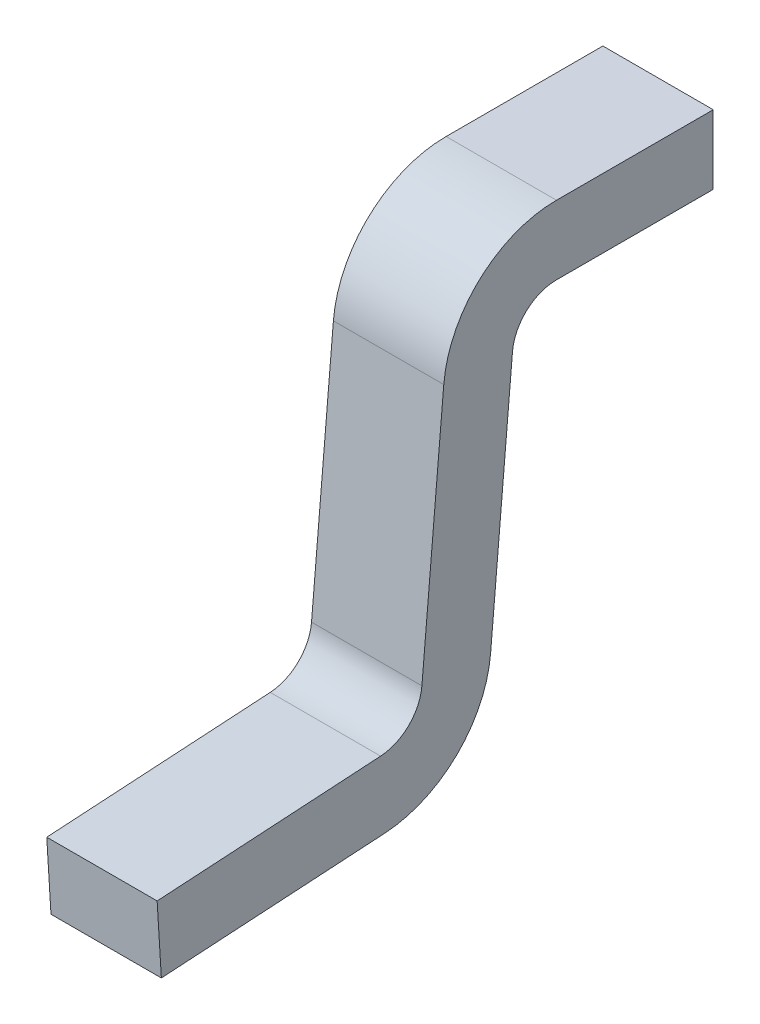
ISO-10303-21;
HEADER;
FILE_DESCRIPTION(('STEP AP214'),'2;1');
FILE_NAME('part.step','',(''),(''),'','','');
FILE_SCHEMA(('AUTOMOTIVE_DESIGN { 1 0 10303 214 1 1 1 1 }'));
ENDSEC;
DATA;
#1=APPLICATION_CONTEXT('core data for automotive mechanical design processes');
#2=APPLICATION_PROTOCOL_DEFINITION('international standard','automotive_design',2000,#1);
#3=PRODUCT_CONTEXT('',#1,'mechanical');
#4=PRODUCT('Part','Part','',(#3));
#5=PRODUCT_RELATED_PRODUCT_CATEGORY('part','',(#4));
#6=PRODUCT_DEFINITION_FORMATION('','',#4);
#7=PRODUCT_DEFINITION_CONTEXT('part definition',#1,'design');
#8=PRODUCT_DEFINITION('design','',#6,#7);
#9=PRODUCT_DEFINITION_SHAPE('','',#8);
#10=(LENGTH_UNIT() NAMED_UNIT(*) SI_UNIT(.MILLI.,.METRE.));
#11=(NAMED_UNIT(*) PLANE_ANGLE_UNIT() SI_UNIT($,.RADIAN.));
#12=(NAMED_UNIT(*) SI_UNIT($,.STERADIAN.) SOLID_ANGLE_UNIT());
#13=UNCERTAINTY_MEASURE_WITH_UNIT(LENGTH_MEASURE(1.E-05),#10,'distance_accuracy_value','');
#14=(GEOMETRIC_REPRESENTATION_CONTEXT(3) GLOBAL_UNCERTAINTY_ASSIGNED_CONTEXT((#13)) GLOBAL_UNIT_ASSIGNED_CONTEXT((#10,
#11,#12)) REPRESENTATION_CONTEXT('',''));
#15=CARTESIAN_POINT('',(0.,0.,0.));
#16=DIRECTION('',(0.,0.,1.));
#17=DIRECTION('',(1.,0.,0.));
#18=AXIS2_PLACEMENT_3D('',#15,#16,#17);
#19=CARTESIAN_POINT('',(0.1,0.,0.));
#20=DIRECTION('',(1.,0.,0.));
#21=DIRECTION('',(0.,0.,-1.));
#22=AXIS2_PLACEMENT_3D('',#19,#20,#21);
#23=PLANE('',#22);
#24=CARTESIAN_POINT('',(0.1,0.4075,-0.11595721739));
#25=DIRECTION('',(-1.,0.,0.));
#26=DIRECTION('',(0.,0.,1.));
#27=AXIS2_PLACEMENT_3D('',#24,#25,#26);
#28=CIRCLE('',#27,0.205);
#29=CARTESIAN_POINT('',(0.1,0.425366927263168,0.0882626957190755));
#30=VERTEX_POINT('',#29);
#31=CARTESIAN_POINT('',(0.1,0.6125,-0.11595721739));
#32=VERTEX_POINT('',#31);
#33=EDGE_CURVE('E196',#30,#32,#28,.T.);
#34=ORIENTED_EDGE('',*,*,#33,.F.);
#35=DIRECTION('',(0.,-0.996194698091747,0.0871557427476379));
#36=VECTOR('',#35,1.);
#37=CARTESIAN_POINT('',(0.1,0.01089446784346,0.124524337262));
#38=LINE('',#37,#36);
#39=CARTESIAN_POINT('',(0.1,-0.0275883544188815,0.127891147950048));
#40=VERTEX_POINT('',#39);
#41=EDGE_CURVE('E193',#40,#30,#38,.F.);
#42=ORIENTED_EDGE('',*,*,#41,.F.);
#43=CARTESIAN_POINT('',(0.1,-0.02061589499909,0.207586723797));
#44=DIRECTION('',(1.,0.,0.));
#45=DIRECTION('',(0.,0.,-1.));
#46=AXIS2_PLACEMENT_3D('',#43,#44,#45);
#47=CIRCLE('',#46,0.08);
#48=CARTESIAN_POINT('',(0.1,-0.10046667887287,0.202702840634609));
#49=VERTEX_POINT('',#48);
#50=EDGE_CURVE('E190',#40,#49,#47,.F.);
#51=ORIENTED_EDGE('',*,*,#50,.T.);
#52=DIRECTION('',(0.,-0.0610485395348519,0.998134798421867));
#53=VECTOR('',#52,1.);
#54=CARTESIAN_POINT('',(0.1,-0.09625845590832,0.133899003353));
#55=LINE('',#54,#53);
#56=CARTESIAN_POINT('',(0.1,-0.125233150197099,0.607631067441994));
#57=VERTEX_POINT('',#56);
#58=EDGE_CURVE('E186',#57,#49,#55,.F.);
#59=ORIENTED_EDGE('',*,*,#58,.F.);
#60=DIRECTION('',(0.,-0.998134798421867,-0.0610485395348519));
#61=VECTOR('',#60,1.);
#62=CARTESIAN_POINT('',(0.1,-0.125233150197,0.607631067442));
#63=LINE('',#62,#61);
#64=CARTESIAN_POINT('',(0.1,-0.250000000000003,0.600000000000042));
#65=VERTEX_POINT('',#64);
#66=EDGE_CURVE('E126',#65,#57,#63,.F.);
#67=ORIENTED_EDGE('',*,*,#66,.F.);
#68=DIRECTION('',(0.,0.0610485395348519,-0.998134798421867));
#69=VECTOR('',#68,1.);
#70=CARTESIAN_POINT('',(0.1,-0.25,0.6));
#71=LINE('',#70,#69);
#72=CARTESIAN_POINT('',(0.1,-0.225233528675585,0.19507177319269));
#73=VERTEX_POINT('',#72);
#74=EDGE_CURVE('E130',#73,#65,#71,.F.);
#75=ORIENTED_EDGE('',*,*,#74,.F.);
#76=CARTESIAN_POINT('',(0.1,-0.02061589499909,0.207586723797));
#77=DIRECTION('',(-1.,0.,0.));
#78=DIRECTION('',(0.,0.,1.));
#79=AXIS2_PLACEMENT_3D('',#76,#77,#78);
#80=CIRCLE('',#79,0.205);
#81=CARTESIAN_POINT('',(0.1,-0.0384828222623575,0.00336681068831962));
#82=VERTEX_POINT('',#81);
#83=EDGE_CURVE('E174',#82,#73,#80,.T.);
#84=ORIENTED_EDGE('',*,*,#83,.F.);
#85=DIRECTION('',(0.,0.996194698091747,-0.0871557427476379));
#86=VECTOR('',#85,1.);
#87=CARTESIAN_POINT('',(0.1,-0.214449957329,0.01876194015991));
#88=LINE('',#87,#86);
#89=CARTESIAN_POINT('',(0.1,0.414472459419905,-0.0362616415428007));
#90=VERTEX_POINT('',#89);
#91=EDGE_CURVE('E90',#90,#82,#88,.F.);
#92=ORIENTED_EDGE('',*,*,#91,.F.);
#93=CARTESIAN_POINT('',(0.1,0.4075,-0.11595721739));
#94=DIRECTION('',(1.,0.,0.));
#95=DIRECTION('',(0.,0.,-1.));
#96=AXIS2_PLACEMENT_3D('',#93,#94,#95);
#97=CIRCLE('',#96,0.08);
#98=CARTESIAN_POINT('',(0.1,0.4875,-0.11595721739));
#99=VERTEX_POINT('',#98);
#100=EDGE_CURVE('E20',#90,#99,#97,.F.);
#101=ORIENTED_EDGE('',*,*,#100,.T.);
#102=DIRECTION('',(0.,0.,-1.));
#103=VECTOR('',#102,1.);
#104=CARTESIAN_POINT('',(0.1,0.4875,-0.04265072346889));
#105=LINE('',#104,#103);
#106=CARTESIAN_POINT('',(0.1,0.4875,-0.4));
#107=VERTEX_POINT('',#106);
#108=EDGE_CURVE('E96',#107,#99,#105,.F.);
#109=ORIENTED_EDGE('',*,*,#108,.F.);
#110=DIRECTION('',(0.,1.,0.));
#111=VECTOR('',#110,1.);
#112=CARTESIAN_POINT('',(0.1,0.4875,-0.4));
#113=LINE('',#112,#111);
#114=CARTESIAN_POINT('',(0.1,0.6125,-0.4));
#115=VERTEX_POINT('',#114);
#116=EDGE_CURVE('E102',#115,#107,#113,.F.);
#117=ORIENTED_EDGE('',*,*,#116,.F.);
#118=DIRECTION('',(0.,0.,1.));
#119=VECTOR('',#118,1.);
#120=CARTESIAN_POINT('',(0.1,0.6125,-0.4));
#121=LINE('',#120,#119);
#122=EDGE_CURVE('E108',#32,#115,#121,.F.);
#123=ORIENTED_EDGE('',*,*,#122,.F.);
#124=EDGE_LOOP('',(#34,#42,#51,#59,#67,#75,#84,#92,#101,#109,#117,#123));
#125=FACE_BOUND('',#124,.T.);
#126=ADVANCED_FACE('F17',(#125),#23,.T.);
#127=CARTESIAN_POINT('',(-0.1,-0.214449957329,0.01876194015991));
#128=DIRECTION('',(0.,-0.0871557427476379,-0.996194698091747));
#129=DIRECTION('',(0.,0.996194698091747,-0.0871557427476379));
#130=AXIS2_PLACEMENT_3D('',#127,#128,#129);
#131=PLANE('',#130);
#132=DIRECTION('',(1.,0.,0.));
#133=VECTOR('',#132,1.);
#134=CARTESIAN_POINT('',(-0.1,0.414472459420023,-0.0362616415426787));
#135=LINE('',#134,#133);
#136=CARTESIAN_POINT('',(-0.1,0.414472459419905,-0.0362616415428));
#137=VERTEX_POINT('',#136);
#138=EDGE_CURVE('E211',#137,#90,#135,.T.);
#139=ORIENTED_EDGE('',*,*,#138,.T.);
#140=ORIENTED_EDGE('',*,*,#91,.T.);
#141=DIRECTION('',(-1.,0.,0.));
#142=VECTOR('',#141,1.);
#143=CARTESIAN_POINT('',(-0.1,-0.0384828222623814,0.00336681068819405));
#144=LINE('',#143,#142);
#145=CARTESIAN_POINT('',(-0.1,-0.0384828222623557,0.00336681068831518));
#146=VERTEX_POINT('',#145);
#147=EDGE_CURVE('E172',#146,#82,#144,.F.);
#148=ORIENTED_EDGE('',*,*,#147,.F.);
#149=DIRECTION('',(0.,0.996194698091749,-0.0871557427476165));
#150=VECTOR('',#149,1.);
#151=CARTESIAN_POINT('',(-0.1,-0.03848282226236,0.003366810688439));
#152=LINE('',#151,#150);
#153=EDGE_CURVE('E169',#146,#137,#152,.T.);
#154=ORIENTED_EDGE('',*,*,#153,.T.);
#155=EDGE_LOOP('',(#139,#140,#148,#154));
#156=FACE_BOUND('',#155,.T.);
#157=ADVANCED_FACE('F257',(#156),#131,.T.);
#158=CARTESIAN_POINT('',(-0.1,0.4075,-0.11595721739));
#159=DIRECTION('',(1.,0.,0.));
#160=DIRECTION('',(0.,0.,-1.));
#161=AXIS2_PLACEMENT_3D('',#158,#159,#160);
#162=CYLINDRICAL_SURFACE('',#161,0.08);
#163=ORIENTED_EDGE('',*,*,#138,.F.);
#164=CARTESIAN_POINT('',(-0.1,0.4075,-0.11595721739));
#165=DIRECTION('',(1.,0.,0.));
#166=DIRECTION('',(0.,0.,-1.));
#167=AXIS2_PLACEMENT_3D('',#164,#165,#166);
#168=CIRCLE('',#167,0.08);
#169=CARTESIAN_POINT('',(-0.1,0.4875,-0.11595721739));
#170=VERTEX_POINT('',#169);
#171=EDGE_CURVE('E166',#137,#170,#168,.F.);
#172=ORIENTED_EDGE('',*,*,#171,.T.);
#173=DIRECTION('',(1.,0.,0.));
#174=VECTOR('',#173,1.);
#175=CARTESIAN_POINT('',(-0.1,0.4875,-0.11595721739));
#176=LINE('',#175,#174);
#177=EDGE_CURVE('E209',#99,#170,#176,.F.);
#178=ORIENTED_EDGE('',*,*,#177,.F.);
#179=ORIENTED_EDGE('',*,*,#100,.F.);
#180=EDGE_LOOP('',(#163,#172,#178,#179));
#181=FACE_BOUND('',#180,.T.);
#182=ADVANCED_FACE('F255',(#181),#162,.F.);
#183=CARTESIAN_POINT('',(-0.1,0.4875,-0.04265072346889));
#184=DIRECTION('',(0.,-1.,0.));
#185=DIRECTION('',(0.,0.,-1.));
#186=AXIS2_PLACEMENT_3D('',#183,#184,#185);
#187=PLANE('',#186);
#188=ORIENTED_EDGE('',*,*,#177,.T.);
#189=DIRECTION('',(0.,0.,-1.));
#190=VECTOR('',#189,1.);
#191=CARTESIAN_POINT('',(-0.1,0.4875,0.));
#192=LINE('',#191,#190);
#193=CARTESIAN_POINT('',(-0.1,0.4875,-0.4));
#194=VERTEX_POINT('',#193);
#195=EDGE_CURVE('E163',#170,#194,#192,.T.);
#196=ORIENTED_EDGE('',*,*,#195,.T.);
#197=DIRECTION('',(-1.,0.,0.));
#198=VECTOR('',#197,1.);
#199=CARTESIAN_POINT('',(-0.1,0.4875,-0.4));
#200=LINE('',#199,#198);
#201=EDGE_CURVE('E205',#107,#194,#200,.T.);
#202=ORIENTED_EDGE('',*,*,#201,.F.);
#203=ORIENTED_EDGE('',*,*,#108,.T.);
#204=EDGE_LOOP('',(#188,#196,#202,#203));
#205=FACE_BOUND('',#204,.T.);
#206=ADVANCED_FACE('F251',(#205),#187,.T.);
#207=CARTESIAN_POINT('',(-0.1,0.4875,-0.4));
#208=DIRECTION('',(0.,0.,-1.));
#209=DIRECTION('',(-1.,0.,0.));
#210=AXIS2_PLACEMENT_3D('',#207,#208,#209);
#211=PLANE('',#210);
#212=ORIENTED_EDGE('',*,*,#201,.T.);
#213=DIRECTION('',(0.,1.,0.));
#214=VECTOR('',#213,1.);
#215=CARTESIAN_POINT('',(-0.1,0.,-0.4));
#216=LINE('',#215,#214);
#217=CARTESIAN_POINT('',(-0.1,0.6125,-0.4));
#218=VERTEX_POINT('',#217);
#219=EDGE_CURVE('E160',#194,#218,#216,.T.);
#220=ORIENTED_EDGE('',*,*,#219,.T.);
#221=DIRECTION('',(1.,0.,0.));
#222=VECTOR('',#221,1.);
#223=CARTESIAN_POINT('',(-0.1,0.6125,-0.4));
#224=LINE('',#223,#222);
#225=EDGE_CURVE('E197',#115,#218,#224,.F.);
#226=ORIENTED_EDGE('',*,*,#225,.F.);
#227=ORIENTED_EDGE('',*,*,#116,.T.);
#228=EDGE_LOOP('',(#212,#220,#226,#227));
#229=FACE_BOUND('',#228,.T.);
#230=ADVANCED_FACE('F250',(#229),#211,.T.);
#231=CARTESIAN_POINT('',(-0.1,0.6125,-0.4));
#232=DIRECTION('',(0.,1.,0.));
#233=DIRECTION('',(0.,0.,1.));
#234=AXIS2_PLACEMENT_3D('',#231,#232,#233);
#235=PLANE('',#234);
#236=ORIENTED_EDGE('',*,*,#225,.T.);
#237=DIRECTION('',(0.,0.,-1.));
#238=VECTOR('',#237,1.);
#239=CARTESIAN_POINT('',(-0.1,0.6125,0.));
#240=LINE('',#239,#238);
#241=CARTESIAN_POINT('',(-0.1,0.6125,-0.11595721739));
#242=VERTEX_POINT('',#241);
#243=EDGE_CURVE('E157',#218,#242,#240,.F.);
#244=ORIENTED_EDGE('',*,*,#243,.T.);
#245=DIRECTION('',(-1.,0.,0.));
#246=VECTOR('',#245,1.);
#247=CARTESIAN_POINT('',(-0.1,0.6125,-0.11595721739));
#248=LINE('',#247,#246);
#249=EDGE_CURVE('E194',#32,#242,#248,.T.);
#250=ORIENTED_EDGE('',*,*,#249,.F.);
#251=ORIENTED_EDGE('',*,*,#122,.T.);
#252=EDGE_LOOP('',(#236,#244,#250,#251));
#253=FACE_BOUND('',#252,.T.);
#254=ADVANCED_FACE('F245',(#253),#235,.T.);
#255=CARTESIAN_POINT('',(-0.1,0.4075,-0.11595721739));
#256=DIRECTION('',(-1.,0.,0.));
#257=DIRECTION('',(0.,0.,1.));
#258=AXIS2_PLACEMENT_3D('',#255,#256,#257);
#259=CYLINDRICAL_SURFACE('',#258,0.205);
#260=CARTESIAN_POINT('',(-0.1,0.4075,-0.11595721739));
#261=DIRECTION('',(-1.,0.,0.));
#262=DIRECTION('',(0.,0.,1.));
#263=AXIS2_PLACEMENT_3D('',#260,#261,#262);
#264=CIRCLE('',#263,0.205);
#265=CARTESIAN_POINT('',(-0.1,0.425366927263171,0.0882626957187951));
#266=VERTEX_POINT('',#265);
#267=EDGE_CURVE('E156',#242,#266,#264,.F.);
#268=ORIENTED_EDGE('',*,*,#267,.T.);
#269=DIRECTION('',(1.,0.,0.));
#270=VECTOR('',#269,1.);
#271=CARTESIAN_POINT('',(-0.1,0.425366927263049,0.0882626957190859));
#272=LINE('',#271,#270);
#273=EDGE_CURVE('E191',#30,#266,#272,.F.);
#274=ORIENTED_EDGE('',*,*,#273,.F.);
#275=ORIENTED_EDGE('',*,*,#33,.T.);
#276=ORIENTED_EDGE('',*,*,#249,.T.);
#277=EDGE_LOOP('',(#268,#274,#275,#276));
#278=FACE_BOUND('',#277,.T.);
#279=ADVANCED_FACE('F243',(#278),#259,.T.);
#280=CARTESIAN_POINT('',(-0.1,0.01089446784346,0.124524337262));
#281=DIRECTION('',(0.,0.0871557427476379,0.996194698091747));
#282=DIRECTION('',(0.,-0.996194698091747,0.0871557427476379));
#283=AXIS2_PLACEMENT_3D('',#280,#281,#282);
#284=PLANE('',#283);
#285=ORIENTED_EDGE('',*,*,#273,.T.);
#286=DIRECTION('',(0.,-0.996194698091724,0.0871557427479029));
#287=VECTOR('',#286,1.);
#288=CARTESIAN_POINT('',(-0.1,0.425366927263,0.08826269571853));
#289=LINE('',#288,#287);
#290=CARTESIAN_POINT('',(-0.1,-0.0275883544189111,0.127891147949831));
#291=VERTEX_POINT('',#290);
#292=EDGE_CURVE('E146',#266,#291,#289,.T.);
#293=ORIENTED_EDGE('',*,*,#292,.T.);
#294=DIRECTION('',(1.,0.,0.));
#295=VECTOR('',#294,1.);
#296=CARTESIAN_POINT('',(-0.1,-0.0275883544189296,0.127891147949663));
#297=LINE('',#296,#295);
#298=EDGE_CURVE('E187',#291,#40,#297,.T.);
#299=ORIENTED_EDGE('',*,*,#298,.T.);
#300=ORIENTED_EDGE('',*,*,#41,.T.);
#301=EDGE_LOOP('',(#285,#293,#299,#300));
#302=FACE_BOUND('',#301,.T.);
#303=ADVANCED_FACE('F266',(#302),#284,.T.);
#304=CARTESIAN_POINT('',(-0.1,-0.02061589499909,0.207586723797));
#305=DIRECTION('',(1.,0.,0.));
#306=DIRECTION('',(0.,0.,-1.));
#307=AXIS2_PLACEMENT_3D('',#304,#305,#306);
#308=CYLINDRICAL_SURFACE('',#307,0.08);
#309=ORIENTED_EDGE('',*,*,#298,.F.);
#310=CARTESIAN_POINT('',(-0.1,-0.02061589499909,0.207586723797));
#311=DIRECTION('',(1.,0.,0.));
#312=DIRECTION('',(0.,0.,-1.));
#313=AXIS2_PLACEMENT_3D('',#310,#311,#312);
#314=CIRCLE('',#313,0.08);
#315=CARTESIAN_POINT('',(-0.1,-0.100466678872925,0.202702840634645));
#316=VERTEX_POINT('',#315);
#317=EDGE_CURVE('E144',#291,#316,#314,.F.);
#318=ORIENTED_EDGE('',*,*,#317,.T.);
#319=DIRECTION('',(1.,0.,0.));
#320=VECTOR('',#319,1.);
#321=CARTESIAN_POINT('',(-0.1,-0.100466678872895,0.202702840635006));
#322=LINE('',#321,#320);
#323=EDGE_CURVE('E143',#49,#316,#322,.F.);
#324=ORIENTED_EDGE('',*,*,#323,.F.);
#325=ORIENTED_EDGE('',*,*,#50,.F.);
#326=EDGE_LOOP('',(#309,#318,#324,#325));
#327=FACE_BOUND('',#326,.T.);
#328=ADVANCED_FACE('F264',(#327),#308,.F.);
#329=CARTESIAN_POINT('',(-0.1,-0.09625845590832,0.133899003353));
#330=DIRECTION('',(0.,0.998134798421867,0.0610485395348519));
#331=DIRECTION('',(0.,-0.0610485395348519,0.998134798421867));
#332=AXIS2_PLACEMENT_3D('',#329,#330,#331);
#333=PLANE('',#332);
#334=ORIENTED_EDGE('',*,*,#323,.T.);
#335=DIRECTION('',(0.,-0.0610485395338605,0.998134798421928));
#336=VECTOR('',#335,1.);
#337=CARTESIAN_POINT('',(-0.1,-0.100466678873,0.202702840635));
#338=LINE('',#337,#336);
#339=CARTESIAN_POINT('',(-0.1,-0.125233150197,0.607631067442));
#340=VERTEX_POINT('',#339);
#341=EDGE_CURVE('E137',#316,#340,#338,.T.);
#342=ORIENTED_EDGE('',*,*,#341,.T.);
#343=DIRECTION('',(1.,0.,0.));
#344=VECTOR('',#343,1.);
#345=CARTESIAN_POINT('',(-0.1,-0.125233150197,0.607631067442));
#346=LINE('',#345,#344);
#347=EDGE_CURVE('E120',#57,#340,#346,.F.);
#348=ORIENTED_EDGE('',*,*,#347,.F.);
#349=ORIENTED_EDGE('',*,*,#58,.T.);
#350=EDGE_LOOP('',(#334,#342,#348,#349));
#351=FACE_BOUND('',#350,.T.);
#352=ADVANCED_FACE('F141',(#351),#333,.T.);
#353=CARTESIAN_POINT('',(-0.1,-0.125233150197,0.607631067442));
#354=DIRECTION('',(0.,-0.0610485395348519,0.998134798421867));
#355=DIRECTION('',(0.,-0.998134798421867,-0.0610485395348519));
#356=AXIS2_PLACEMENT_3D('',#353,#354,#355);
#357=PLANE('',#356);
#358=ORIENTED_EDGE('',*,*,#347,.T.);
#359=DIRECTION('',(0.,-0.998134798421805,-0.061048539535866));
#360=VECTOR('',#359,1.);
#361=CARTESIAN_POINT('',(-0.1,-0.125233150197,0.607631067442));
#362=LINE('',#361,#360);
#363=CARTESIAN_POINT('',(-0.1,-0.25,0.6));
#364=VERTEX_POINT('',#363);
#365=EDGE_CURVE('E124',#340,#364,#362,.T.);
#366=ORIENTED_EDGE('',*,*,#365,.T.);
#367=DIRECTION('',(1.,0.,0.));
#368=VECTOR('',#367,1.);
#369=CARTESIAN_POINT('',(-0.1,-0.25,0.6));
#370=LINE('',#369,#368);
#371=EDGE_CURVE('E177',#65,#364,#370,.F.);
#372=ORIENTED_EDGE('',*,*,#371,.F.);
#373=ORIENTED_EDGE('',*,*,#66,.T.);
#374=EDGE_LOOP('',(#358,#366,#372,#373));
#375=FACE_BOUND('',#374,.T.);
#376=ADVANCED_FACE('F122',(#375),#357,.T.);
#377=CARTESIAN_POINT('',(-0.1,-0.25,0.6));
#378=DIRECTION('',(0.,-0.998134798421867,-0.0610485395348519));
#379=DIRECTION('',(0.,0.0610485395348519,-0.998134798421867));
#380=AXIS2_PLACEMENT_3D('',#377,#378,#379);
#381=PLANE('',#380);
#382=ORIENTED_EDGE('',*,*,#371,.T.);
#383=DIRECTION('',(0.,0.0610485395338606,-0.998134798421928));
#384=VECTOR('',#383,1.);
#385=CARTESIAN_POINT('',(-0.1,-0.25,0.6));
#386=LINE('',#385,#384);
#387=CARTESIAN_POINT('',(-0.1,-0.225233528675793,0.195071773192779));
#388=VERTEX_POINT('',#387);
#389=EDGE_CURVE('E26',#364,#388,#386,.T.);
#390=ORIENTED_EDGE('',*,*,#389,.T.);
#391=DIRECTION('',(-1.,0.,0.));
#392=VECTOR('',#391,1.);
#393=CARTESIAN_POINT('',(-0.1,-0.225233528675614,0.195071773193024));
#394=LINE('',#393,#392);
#395=EDGE_CURVE('E34',#73,#388,#394,.T.);
#396=ORIENTED_EDGE('',*,*,#395,.F.);
#397=ORIENTED_EDGE('',*,*,#74,.T.);
#398=EDGE_LOOP('',(#382,#390,#396,#397));
#399=FACE_BOUND('',#398,.T.);
#400=ADVANCED_FACE('F260',(#399),#381,.T.);
#401=CARTESIAN_POINT('',(-0.1,-0.02061589499909,0.207586723797));
#402=DIRECTION('',(-1.,0.,0.));
#403=DIRECTION('',(0.,0.,1.));
#404=AXIS2_PLACEMENT_3D('',#401,#402,#403);
#405=CYLINDRICAL_SURFACE('',#404,0.205);
#406=CARTESIAN_POINT('',(-0.1,-0.02061589499909,0.207586723797));
#407=DIRECTION('',(-1.,0.,0.));
#408=DIRECTION('',(0.,0.,1.));
#409=AXIS2_PLACEMENT_3D('',#406,#407,#408);
#410=CIRCLE('',#409,0.205);
#411=EDGE_CURVE('E11',#388,#146,#410,.F.);
#412=ORIENTED_EDGE('',*,*,#411,.T.);
#413=ORIENTED_EDGE('',*,*,#147,.T.);
#414=ORIENTED_EDGE('',*,*,#83,.T.);
#415=ORIENTED_EDGE('',*,*,#395,.T.);
#416=EDGE_LOOP('',(#412,#413,#414,#415));
#417=FACE_BOUND('',#416,.T.);
#418=ADVANCED_FACE('F277',(#417),#405,.T.);
#419=CARTESIAN_POINT('',(-0.1,0.,0.));
#420=DIRECTION('',(1.,0.,0.));
#421=DIRECTION('',(0.,0.,-1.));
#422=AXIS2_PLACEMENT_3D('',#419,#420,#421);
#423=PLANE('',#422);
#424=ORIENTED_EDGE('',*,*,#389,.F.);
#425=ORIENTED_EDGE('',*,*,#365,.F.);
#426=ORIENTED_EDGE('',*,*,#341,.F.);
#427=ORIENTED_EDGE('',*,*,#317,.F.);
#428=ORIENTED_EDGE('',*,*,#292,.F.);
#429=ORIENTED_EDGE('',*,*,#267,.F.);
#430=ORIENTED_EDGE('',*,*,#243,.F.);
#431=ORIENTED_EDGE('',*,*,#219,.F.);
#432=ORIENTED_EDGE('',*,*,#195,.F.);
#433=ORIENTED_EDGE('',*,*,#171,.F.);
#434=ORIENTED_EDGE('',*,*,#153,.F.);
#435=ORIENTED_EDGE('',*,*,#411,.F.);
#436=EDGE_LOOP('',(#424,#425,#426,#427,#428,#429,#430,#431,#432,#433,#434,#435));
#437=FACE_BOUND('',#436,.T.);
#438=ADVANCED_FACE('F135',(#437),#423,.F.);
#439=CLOSED_SHELL('',(#126,#157,#182,#206,#230,#254,#279,#303,#328,#352,#376,#400,#418,#438));
#440=MANIFOLD_SOLID_BREP('B1',#439);
#441=ADVANCED_BREP_SHAPE_REPRESENTATION('',(#18,#440),#14);
#442=SHAPE_DEFINITION_REPRESENTATION(#9,#441);
ENDSEC;
END-ISO-10303-21;
